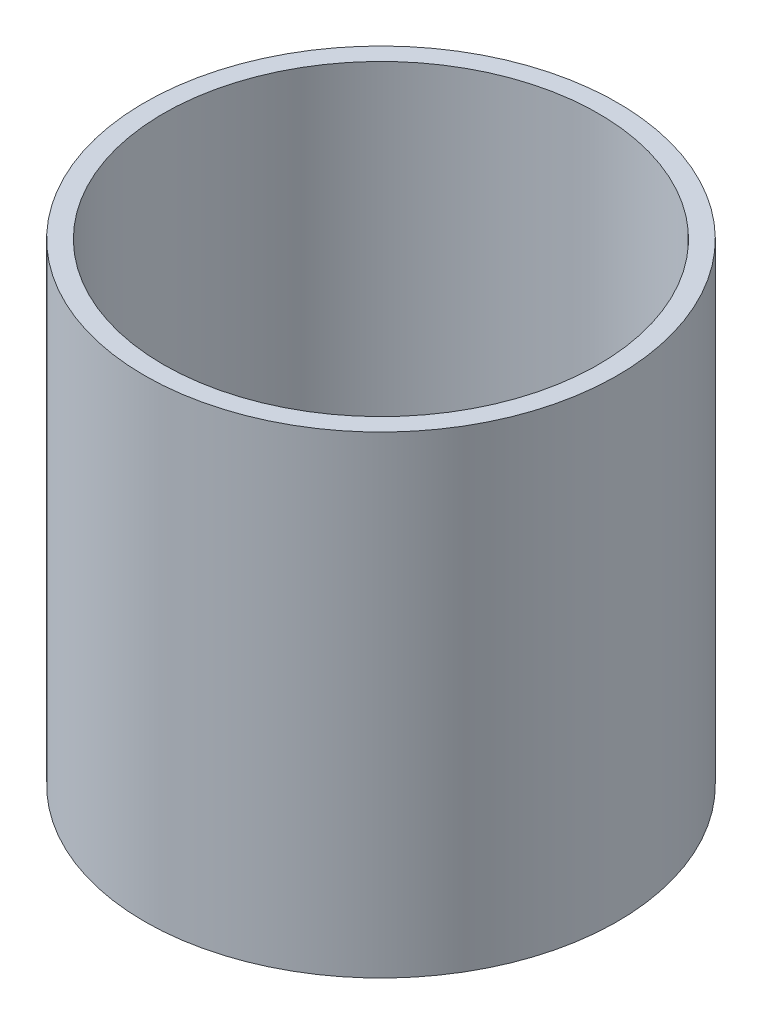
ISO-10303-21;
HEADER;
FILE_DESCRIPTION(('STEP AP214'),'2;1');
FILE_NAME('part.step','',(''),(''),'','','');
FILE_SCHEMA(('AUTOMOTIVE_DESIGN { 1 0 10303 214 1 1 1 1 }'));
ENDSEC;
DATA;
#1=APPLICATION_CONTEXT('core data for automotive mechanical design processes');
#2=APPLICATION_PROTOCOL_DEFINITION('international standard','automotive_design',2000,#1);
#3=PRODUCT_CONTEXT('',#1,'mechanical');
#4=PRODUCT('Part','Part','',(#3));
#5=PRODUCT_RELATED_PRODUCT_CATEGORY('part','',(#4));
#6=PRODUCT_DEFINITION_FORMATION('','',#4);
#7=PRODUCT_DEFINITION_CONTEXT('part definition',#1,'design');
#8=PRODUCT_DEFINITION('design','',#6,#7);
#9=PRODUCT_DEFINITION_SHAPE('','',#8);
#10=(LENGTH_UNIT() NAMED_UNIT(*) SI_UNIT(.MILLI.,.METRE.));
#11=(NAMED_UNIT(*) PLANE_ANGLE_UNIT() SI_UNIT($,.RADIAN.));
#12=(NAMED_UNIT(*) SI_UNIT($,.STERADIAN.) SOLID_ANGLE_UNIT());
#13=UNCERTAINTY_MEASURE_WITH_UNIT(LENGTH_MEASURE(1.E-05),#10,'distance_accuracy_value','');
#14=(GEOMETRIC_REPRESENTATION_CONTEXT(3) GLOBAL_UNCERTAINTY_ASSIGNED_CONTEXT((#13)) GLOBAL_UNIT_ASSIGNED_CONTEXT((#10,
#11,#12)) REPRESENTATION_CONTEXT('',''));
#15=CARTESIAN_POINT('',(0.,0.,0.));
#16=DIRECTION('',(0.,0.,1.));
#17=DIRECTION('',(1.,0.,0.));
#18=AXIS2_PLACEMENT_3D('',#15,#16,#17);
#19=CARTESIAN_POINT('',(0.,6.35,0.));
#20=DIRECTION('',(0.,1.,0.));
#21=DIRECTION('',(0.,0.,1.));
#22=AXIS2_PLACEMENT_3D('',#19,#20,#21);
#23=PLANE('',#22);
#24=CARTESIAN_POINT('',(0.,6.35,0.));
#25=DIRECTION('',(0.,1.,0.));
#26=DIRECTION('',(0.,0.,1.));
#27=AXIS2_PLACEMENT_3D('',#24,#25,#26);
#28=CIRCLE('',#27,3.175);
#29=CARTESIAN_POINT('',(0.,6.35,3.175));
#30=VERTEX_POINT('',#29);
#31=EDGE_CURVE('E10',#30,#30,#28,.T.);
#32=ORIENTED_EDGE('',*,*,#31,.T.);
#33=EDGE_LOOP('',(#32));
#34=FACE_BOUND('',#33,.T.);
#35=CARTESIAN_POINT('',(0.,6.35,0.));
#36=DIRECTION('',(0.,1.,0.));
#37=DIRECTION('',(0.,0.,1.));
#38=AXIS2_PLACEMENT_3D('',#35,#36,#37);
#39=CIRCLE('',#38,2.921);
#40=CARTESIAN_POINT('',(0.,6.35,2.921));
#41=VERTEX_POINT('',#40);
#42=EDGE_CURVE('E42',#41,#41,#39,.T.);
#43=ORIENTED_EDGE('',*,*,#42,.F.);
#44=EDGE_LOOP('',(#43));
#45=FACE_BOUND('',#44,.T.);
#46=ADVANCED_FACE('F31',(#34,#45),#23,.T.);
#47=CARTESIAN_POINT('',(0.,0.,0.));
#48=DIRECTION('',(0.,1.,0.));
#49=DIRECTION('',(0.,0.,1.));
#50=AXIS2_PLACEMENT_3D('',#47,#48,#49);
#51=PLANE('',#50);
#52=CARTESIAN_POINT('',(0.,0.,0.));
#53=DIRECTION('',(0.,1.,0.));
#54=DIRECTION('',(0.,0.,1.));
#55=AXIS2_PLACEMENT_3D('',#52,#53,#54);
#56=CIRCLE('',#55,3.175);
#57=CARTESIAN_POINT('',(0.,0.,3.175));
#58=VERTEX_POINT('',#57);
#59=EDGE_CURVE('E35',#58,#58,#56,.T.);
#60=ORIENTED_EDGE('',*,*,#59,.F.);
#61=EDGE_LOOP('',(#60));
#62=FACE_BOUND('',#61,.T.);
#63=CARTESIAN_POINT('',(0.,0.,0.));
#64=DIRECTION('',(0.,1.,0.));
#65=DIRECTION('',(0.,0.,1.));
#66=AXIS2_PLACEMENT_3D('',#63,#64,#65);
#67=CIRCLE('',#66,2.921);
#68=CARTESIAN_POINT('',(0.,0.,2.921));
#69=VERTEX_POINT('',#68);
#70=EDGE_CURVE('E44',#69,#69,#67,.T.);
#71=ORIENTED_EDGE('',*,*,#70,.T.);
#72=EDGE_LOOP('',(#71));
#73=FACE_BOUND('',#72,.T.);
#74=ADVANCED_FACE('F54',(#62,#73),#51,.F.);
#75=CARTESIAN_POINT('',(0.,6.35,0.));
#76=DIRECTION('',(0.,-1.,0.));
#77=DIRECTION('',(0.,0.,-1.));
#78=AXIS2_PLACEMENT_3D('',#75,#76,#77);
#79=CYLINDRICAL_SURFACE('',#78,3.175);
#80=ORIENTED_EDGE('',*,*,#31,.F.);
#81=EDGE_LOOP('',(#80));
#82=FACE_BOUND('',#81,.T.);
#83=ORIENTED_EDGE('',*,*,#59,.T.);
#84=EDGE_LOOP('',(#83));
#85=FACE_BOUND('',#84,.T.);
#86=ADVANCED_FACE('F33',(#82,#85),#79,.T.);
#87=CARTESIAN_POINT('',(0.,6.35,0.));
#88=DIRECTION('',(0.,-1.,0.));
#89=DIRECTION('',(0.,0.,-1.));
#90=AXIS2_PLACEMENT_3D('',#87,#88,#89);
#91=CYLINDRICAL_SURFACE('',#90,2.921);
#92=ORIENTED_EDGE('',*,*,#42,.T.);
#93=EDGE_LOOP('',(#92));
#94=FACE_BOUND('',#93,.T.);
#95=ORIENTED_EDGE('',*,*,#70,.F.);
#96=EDGE_LOOP('',(#95));
#97=FACE_BOUND('',#96,.T.);
#98=ADVANCED_FACE('F50',(#94,#97),#91,.F.);
#99=CLOSED_SHELL('',(#46,#74,#86,#98));
#100=MANIFOLD_SOLID_BREP('B2',#99);
#101=ADVANCED_BREP_SHAPE_REPRESENTATION('',(#18,#100),#14);
#102=SHAPE_DEFINITION_REPRESENTATION(#9,#101);
ENDSEC;
END-ISO-10303-21;
